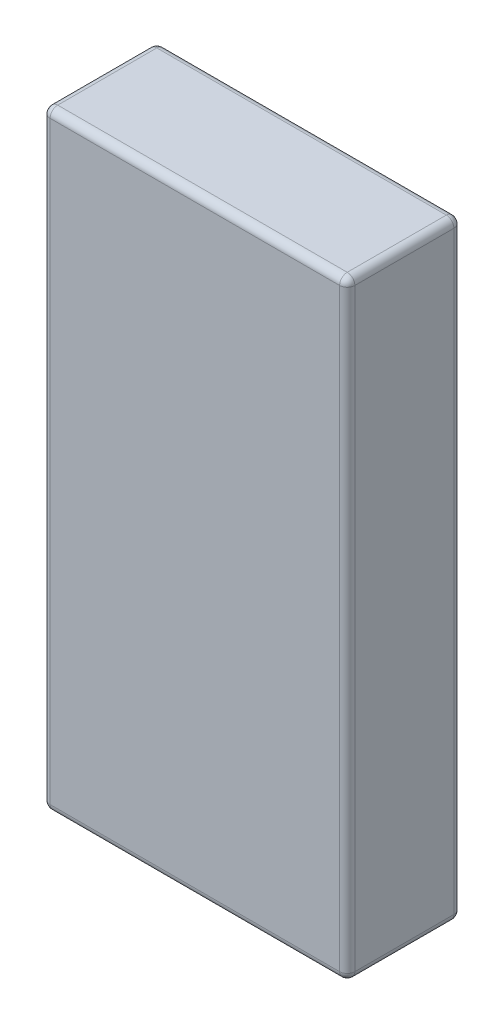
ISO-10303-21;
HEADER;
FILE_DESCRIPTION(('STEP AP214'),'2;1');
FILE_NAME('part.step','',(''),(''),'','','');
FILE_SCHEMA(('AUTOMOTIVE_DESIGN { 1 0 10303 214 1 1 1 1 }'));
ENDSEC;
DATA;
#1=APPLICATION_CONTEXT('core data for automotive mechanical design processes');
#2=APPLICATION_PROTOCOL_DEFINITION('international standard','automotive_design',2000,#1);
#3=PRODUCT_CONTEXT('',#1,'mechanical');
#4=PRODUCT('Part','Part','',(#3));
#5=PRODUCT_RELATED_PRODUCT_CATEGORY('part','',(#4));
#6=PRODUCT_DEFINITION_FORMATION('','',#4);
#7=PRODUCT_DEFINITION_CONTEXT('part definition',#1,'design');
#8=PRODUCT_DEFINITION('design','',#6,#7);
#9=PRODUCT_DEFINITION_SHAPE('','',#8);
#10=(LENGTH_UNIT() NAMED_UNIT(*) SI_UNIT(.MILLI.,.METRE.));
#11=(NAMED_UNIT(*) PLANE_ANGLE_UNIT() SI_UNIT($,.RADIAN.));
#12=(NAMED_UNIT(*) SI_UNIT($,.STERADIAN.) SOLID_ANGLE_UNIT());
#13=UNCERTAINTY_MEASURE_WITH_UNIT(LENGTH_MEASURE(1.E-05),#10,'distance_accuracy_value','');
#14=(GEOMETRIC_REPRESENTATION_CONTEXT(3) GLOBAL_UNCERTAINTY_ASSIGNED_CONTEXT((#13)) GLOBAL_UNIT_ASSIGNED_CONTEXT((#10,
#11,#12)) REPRESENTATION_CONTEXT('',''));
#15=CARTESIAN_POINT('',(0.,0.,0.));
#16=DIRECTION('',(0.,0.,1.));
#17=DIRECTION('',(1.,0.,0.));
#18=AXIS2_PLACEMENT_3D('',#15,#16,#17);
#19=CARTESIAN_POINT('',(2.,-4.,1.5));
#20=DIRECTION('',(-1.,0.,0.));
#21=DIRECTION('',(0.,0.,1.));
#22=AXIS2_PLACEMENT_3D('',#19,#20,#21);
#23=PLANE('',#22);
#24=DIRECTION('',(0.,1.,0.));
#25=VECTOR('',#24,1.);
#26=CARTESIAN_POINT('',(2.,-4.,1.4));
#27=LINE('',#26,#25);
#28=CARTESIAN_POINT('',(2.,3.9,1.4));
#29=VERTEX_POINT('',#28);
#30=CARTESIAN_POINT('',(2.,-3.9,1.4));
#31=VERTEX_POINT('',#30);
#32=EDGE_CURVE('E190',#29,#31,#27,.F.);
#33=ORIENTED_EDGE('',*,*,#32,.T.);
#34=DIRECTION('',(0.,0.,-1.));
#35=VECTOR('',#34,1.);
#36=CARTESIAN_POINT('',(2.,-3.9,1.5));
#37=LINE('',#36,#35);
#38=CARTESIAN_POINT('',(2.,-3.9,0.1));
#39=VERTEX_POINT('',#38);
#40=EDGE_CURVE('E192',#31,#39,#37,.T.);
#41=ORIENTED_EDGE('',*,*,#40,.T.);
#42=DIRECTION('',(0.,1.,0.));
#43=VECTOR('',#42,1.);
#44=CARTESIAN_POINT('',(2.,4.,0.1));
#45=LINE('',#44,#43);
#46=CARTESIAN_POINT('',(2.,3.9,0.1));
#47=VERTEX_POINT('',#46);
#48=EDGE_CURVE('E186',#39,#47,#45,.T.);
#49=ORIENTED_EDGE('',*,*,#48,.T.);
#50=DIRECTION('',(0.,0.,-1.));
#51=VECTOR('',#50,1.);
#52=CARTESIAN_POINT('',(2.,3.9,1.5));
#53=LINE('',#52,#51);
#54=EDGE_CURVE('E188',#47,#29,#53,.F.);
#55=ORIENTED_EDGE('',*,*,#54,.T.);
#56=EDGE_LOOP('',(#33,#41,#49,#55));
#57=FACE_BOUND('',#56,.T.);
#58=ADVANCED_FACE('F35',(#57),#23,.F.);
#59=CARTESIAN_POINT('',(-2.,4.,1.5));
#60=DIRECTION('',(0.,-1.,0.));
#61=DIRECTION('',(0.,0.,-1.));
#62=AXIS2_PLACEMENT_3D('',#59,#60,#61);
#63=PLANE('',#62);
#64=DIRECTION('',(0.,0.,-1.));
#65=VECTOR('',#64,1.);
#66=CARTESIAN_POINT('',(-1.9,4.,1.5));
#67=LINE('',#66,#65);
#68=CARTESIAN_POINT('',(-1.9,4.,0.1));
#69=VERTEX_POINT('',#68);
#70=CARTESIAN_POINT('',(-1.9,4.,1.4));
#71=VERTEX_POINT('',#70);
#72=EDGE_CURVE('E181',#69,#71,#67,.F.);
#73=ORIENTED_EDGE('',*,*,#72,.T.);
#74=DIRECTION('',(-1.,0.,0.));
#75=VECTOR('',#74,1.);
#76=CARTESIAN_POINT('',(-2.,4.,1.4));
#77=LINE('',#76,#75);
#78=CARTESIAN_POINT('',(1.9,4.,1.4));
#79=VERTEX_POINT('',#78);
#80=EDGE_CURVE('E183',#71,#79,#77,.F.);
#81=ORIENTED_EDGE('',*,*,#80,.T.);
#82=DIRECTION('',(0.,0.,-1.));
#83=VECTOR('',#82,1.);
#84=CARTESIAN_POINT('',(1.9,4.,1.5));
#85=LINE('',#84,#83);
#86=CARTESIAN_POINT('',(1.9,4.,0.1));
#87=VERTEX_POINT('',#86);
#88=EDGE_CURVE('E179',#79,#87,#85,.T.);
#89=ORIENTED_EDGE('',*,*,#88,.T.);
#90=DIRECTION('',(-1.,0.,0.));
#91=VECTOR('',#90,1.);
#92=CARTESIAN_POINT('',(-2.,4.,0.1));
#93=LINE('',#92,#91);
#94=EDGE_CURVE('E177',#87,#69,#93,.T.);
#95=ORIENTED_EDGE('',*,*,#94,.T.);
#96=EDGE_LOOP('',(#73,#81,#89,#95));
#97=FACE_BOUND('',#96,.T.);
#98=ADVANCED_FACE('F267',(#97),#63,.F.);
#99=CARTESIAN_POINT('',(-2.,-4.,1.5));
#100=DIRECTION('',(1.,0.,0.));
#101=DIRECTION('',(0.,0.,-1.));
#102=AXIS2_PLACEMENT_3D('',#99,#100,#101);
#103=PLANE('',#102);
#104=DIRECTION('',(0.,-1.,0.));
#105=VECTOR('',#104,1.);
#106=CARTESIAN_POINT('',(-2.,-4.,0.1));
#107=LINE('',#106,#105);
#108=CARTESIAN_POINT('',(-2.,3.9,0.1));
#109=VERTEX_POINT('',#108);
#110=CARTESIAN_POINT('',(-2.,-3.9,0.1));
#111=VERTEX_POINT('',#110);
#112=EDGE_CURVE('E157',#109,#111,#107,.T.);
#113=ORIENTED_EDGE('',*,*,#112,.T.);
#114=DIRECTION('',(0.,0.,-1.));
#115=VECTOR('',#114,1.);
#116=CARTESIAN_POINT('',(-2.,-3.9,1.5));
#117=LINE('',#116,#115);
#118=CARTESIAN_POINT('',(-2.,-3.9,1.4));
#119=VERTEX_POINT('',#118);
#120=EDGE_CURVE('E130',#111,#119,#117,.F.);
#121=ORIENTED_EDGE('',*,*,#120,.T.);
#122=DIRECTION('',(0.,-1.,0.));
#123=VECTOR('',#122,1.);
#124=CARTESIAN_POINT('',(-2.,-4.,1.4));
#125=LINE('',#124,#123);
#126=CARTESIAN_POINT('',(-2.,3.9,1.4));
#127=VERTEX_POINT('',#126);
#128=EDGE_CURVE('E165',#119,#127,#125,.F.);
#129=ORIENTED_EDGE('',*,*,#128,.T.);
#130=DIRECTION('',(0.,0.,-1.));
#131=VECTOR('',#130,1.);
#132=CARTESIAN_POINT('',(-2.,3.9,1.5));
#133=LINE('',#132,#131);
#134=EDGE_CURVE('E159',#127,#109,#133,.T.);
#135=ORIENTED_EDGE('',*,*,#134,.T.);
#136=EDGE_LOOP('',(#113,#121,#129,#135));
#137=FACE_BOUND('',#136,.T.);
#138=ADVANCED_FACE('F328',(#137),#103,.F.);
#139=CARTESIAN_POINT('',(-2.,-4.,1.5));
#140=DIRECTION('',(0.,1.,0.));
#141=DIRECTION('',(0.,0.,1.));
#142=AXIS2_PLACEMENT_3D('',#139,#140,#141);
#143=PLANE('',#142);
#144=DIRECTION('',(1.,0.,0.));
#145=VECTOR('',#144,1.);
#146=CARTESIAN_POINT('',(-2.,-4.,1.4));
#147=LINE('',#146,#145);
#148=CARTESIAN_POINT('',(1.9,-4.,1.4));
#149=VERTEX_POINT('',#148);
#150=CARTESIAN_POINT('',(-1.9,-4.,1.4));
#151=VERTEX_POINT('',#150);
#152=EDGE_CURVE('E155',#149,#151,#147,.F.);
#153=ORIENTED_EDGE('',*,*,#152,.T.);
#154=DIRECTION('',(0.,0.,-1.));
#155=VECTOR('',#154,1.);
#156=CARTESIAN_POINT('',(-1.9,-4.,1.5));
#157=LINE('',#156,#155);
#158=CARTESIAN_POINT('',(-1.9,-4.,0.1));
#159=VERTEX_POINT('',#158);
#160=EDGE_CURVE('E128',#151,#159,#157,.T.);
#161=ORIENTED_EDGE('',*,*,#160,.T.);
#162=DIRECTION('',(1.,0.,0.));
#163=VECTOR('',#162,1.);
#164=CARTESIAN_POINT('',(2.,-4.,0.1));
#165=LINE('',#164,#163);
#166=CARTESIAN_POINT('',(1.9,-4.,0.1));
#167=VERTEX_POINT('',#166);
#168=EDGE_CURVE('E145',#159,#167,#165,.T.);
#169=ORIENTED_EDGE('',*,*,#168,.T.);
#170=DIRECTION('',(0.,0.,-1.));
#171=VECTOR('',#170,1.);
#172=CARTESIAN_POINT('',(1.9,-4.,1.5));
#173=LINE('',#172,#171);
#174=EDGE_CURVE('E151',#167,#149,#173,.F.);
#175=ORIENTED_EDGE('',*,*,#174,.T.);
#176=EDGE_LOOP('',(#153,#161,#169,#175));
#177=FACE_BOUND('',#176,.T.);
#178=ADVANCED_FACE('F153',(#177),#143,.F.);
#179=CARTESIAN_POINT('',(0.,0.,1.5));
#180=DIRECTION('',(0.,0.,-1.));
#181=DIRECTION('',(-1.,0.,0.));
#182=AXIS2_PLACEMENT_3D('',#179,#180,#181);
#183=PLANE('',#182);
#184=DIRECTION('',(0.,-1.,0.));
#185=VECTOR('',#184,1.);
#186=CARTESIAN_POINT('',(-1.9,0.,1.5));
#187=LINE('',#186,#185);
#188=CARTESIAN_POINT('',(-1.9,3.9,1.5));
#189=VERTEX_POINT('',#188);
#190=CARTESIAN_POINT('',(-1.9,-3.9,1.5));
#191=VERTEX_POINT('',#190);
#192=EDGE_CURVE('E172',#189,#191,#187,.T.);
#193=ORIENTED_EDGE('',*,*,#192,.T.);
#194=DIRECTION('',(1.,0.,0.));
#195=VECTOR('',#194,1.);
#196=CARTESIAN_POINT('',(0.,-3.9,1.5));
#197=LINE('',#196,#195);
#198=CARTESIAN_POINT('',(1.9,-3.9,1.5));
#199=VERTEX_POINT('',#198);
#200=EDGE_CURVE('E174',#191,#199,#197,.T.);
#201=ORIENTED_EDGE('',*,*,#200,.T.);
#202=DIRECTION('',(0.,1.,0.));
#203=VECTOR('',#202,1.);
#204=CARTESIAN_POINT('',(1.9,0.,1.5));
#205=LINE('',#204,#203);
#206=CARTESIAN_POINT('',(1.9,3.9,1.5));
#207=VERTEX_POINT('',#206);
#208=EDGE_CURVE('E168',#199,#207,#205,.T.);
#209=ORIENTED_EDGE('',*,*,#208,.T.);
#210=DIRECTION('',(-1.,0.,0.));
#211=VECTOR('',#210,1.);
#212=CARTESIAN_POINT('',(0.,3.9,1.5));
#213=LINE('',#212,#211);
#214=EDGE_CURVE('E170',#207,#189,#213,.T.);
#215=ORIENTED_EDGE('',*,*,#214,.T.);
#216=EDGE_LOOP('',(#193,#201,#209,#215));
#217=FACE_BOUND('',#216,.T.);
#218=ADVANCED_FACE('F288',(#217),#183,.F.);
#219=CARTESIAN_POINT('',(0.,0.,0.));
#220=DIRECTION('',(0.,0.,-1.));
#221=DIRECTION('',(-1.,0.,0.));
#222=AXIS2_PLACEMENT_3D('',#219,#220,#221);
#223=PLANE('',#222);
#224=DIRECTION('',(0.,-1.,0.));
#225=VECTOR('',#224,1.);
#226=CARTESIAN_POINT('',(-1.9,4.,0.));
#227=LINE('',#226,#225);
#228=CARTESIAN_POINT('',(-1.9,-3.9,0.));
#229=VERTEX_POINT('',#228);
#230=CARTESIAN_POINT('',(-1.9,3.9,0.));
#231=VERTEX_POINT('',#230);
#232=EDGE_CURVE('E44',#229,#231,#227,.F.);
#233=ORIENTED_EDGE('',*,*,#232,.T.);
#234=DIRECTION('',(-1.,0.,0.));
#235=VECTOR('',#234,1.);
#236=CARTESIAN_POINT('',(2.,3.9,0.));
#237=LINE('',#236,#235);
#238=CARTESIAN_POINT('',(1.9,3.9,0.));
#239=VERTEX_POINT('',#238);
#240=EDGE_CURVE('E11',#231,#239,#237,.F.);
#241=ORIENTED_EDGE('',*,*,#240,.T.);
#242=DIRECTION('',(0.,1.,0.));
#243=VECTOR('',#242,1.);
#244=CARTESIAN_POINT('',(1.9,-4.,0.));
#245=LINE('',#244,#243);
#246=CARTESIAN_POINT('',(1.9,-3.9,0.));
#247=VERTEX_POINT('',#246);
#248=EDGE_CURVE('E195',#239,#247,#245,.F.);
#249=ORIENTED_EDGE('',*,*,#248,.T.);
#250=DIRECTION('',(1.,0.,0.));
#251=VECTOR('',#250,1.);
#252=CARTESIAN_POINT('',(-2.,-3.9,0.));
#253=LINE('',#252,#251);
#254=EDGE_CURVE('E55',#247,#229,#253,.F.);
#255=ORIENTED_EDGE('',*,*,#254,.T.);
#256=EDGE_LOOP('',(#233,#241,#249,#255));
#257=FACE_BOUND('',#256,.T.);
#258=ADVANCED_FACE('F314',(#257),#223,.T.);
#259=CARTESIAN_POINT('',(1.9,3.9,1.5));
#260=DIRECTION('',(0.,0.,-1.));
#261=DIRECTION('',(-1.,0.,0.));
#262=AXIS2_PLACEMENT_3D('',#259,#260,#261);
#263=CYLINDRICAL_SURFACE('',#262,0.1);
#264=CARTESIAN_POINT('',(1.9,3.9,1.4));
#265=DIRECTION('',(0.,0.,1.));
#266=DIRECTION('',(1.,0.,0.));
#267=AXIS2_PLACEMENT_3D('',#264,#265,#266);
#268=CIRCLE('',#267,0.1);
#269=EDGE_CURVE('E39',#29,#79,#268,.T.);
#270=ORIENTED_EDGE('',*,*,#269,.F.);
#271=ORIENTED_EDGE('',*,*,#54,.F.);
#272=CARTESIAN_POINT('',(1.9,3.9,0.1));
#273=DIRECTION('',(0.,0.,-1.));
#274=DIRECTION('',(-1.,0.,0.));
#275=AXIS2_PLACEMENT_3D('',#272,#273,#274);
#276=CIRCLE('',#275,0.1);
#277=EDGE_CURVE('E248',#87,#47,#276,.T.);
#278=ORIENTED_EDGE('',*,*,#277,.F.);
#279=ORIENTED_EDGE('',*,*,#88,.F.);
#280=EDGE_LOOP('',(#270,#271,#278,#279));
#281=FACE_BOUND('',#280,.T.);
#282=ADVANCED_FACE('F37',(#281),#263,.T.);
#283=CARTESIAN_POINT('',(1.9,3.9,1.4));
#284=DIRECTION('',(0.,0.,1.));
#285=DIRECTION('',(1.,0.,0.));
#286=AXIS2_PLACEMENT_3D('',#283,#284,#285);
#287=SPHERICAL_SURFACE('',#286,0.1);
#288=CARTESIAN_POINT('',(1.9,3.9,1.4));
#289=DIRECTION('',(0.,1.,0.));
#290=DIRECTION('',(0.,0.,1.));
#291=AXIS2_PLACEMENT_3D('',#288,#289,#290);
#292=CIRCLE('',#291,0.1);
#293=EDGE_CURVE('E244',#29,#207,#292,.F.);
#294=ORIENTED_EDGE('',*,*,#293,.F.);
#295=ORIENTED_EDGE('',*,*,#269,.T.);
#296=CARTESIAN_POINT('',(1.9,3.9,1.4));
#297=DIRECTION('',(1.,0.,0.));
#298=DIRECTION('',(0.,0.,-1.));
#299=AXIS2_PLACEMENT_3D('',#296,#297,#298);
#300=CIRCLE('',#299,0.1);
#301=EDGE_CURVE('E247',#207,#79,#300,.F.);
#302=ORIENTED_EDGE('',*,*,#301,.F.);
#303=EDGE_LOOP('',(#294,#295,#302));
#304=FACE_BOUND('',#303,.T.);
#305=ADVANCED_FACE('F260',(#304),#287,.T.);
#306=CARTESIAN_POINT('',(1.9,3.9,0.1));
#307=DIRECTION('',(0.,0.,1.));
#308=DIRECTION('',(1.,0.,0.));
#309=AXIS2_PLACEMENT_3D('',#306,#307,#308);
#310=SPHERICAL_SURFACE('',#309,0.1);
#311=CARTESIAN_POINT('',(1.9,3.9,0.1));
#312=DIRECTION('',(1.,0.,0.));
#313=DIRECTION('',(0.,1.,0.));
#314=AXIS2_PLACEMENT_3D('',#311,#312,#313);
#315=CIRCLE('',#314,0.1);
#316=EDGE_CURVE('E238',#87,#239,#315,.F.);
#317=ORIENTED_EDGE('',*,*,#316,.F.);
#318=ORIENTED_EDGE('',*,*,#277,.T.);
#319=CARTESIAN_POINT('',(1.9,3.9,0.1));
#320=DIRECTION('',(0.,1.,0.));
#321=DIRECTION('',(0.,0.,1.));
#322=AXIS2_PLACEMENT_3D('',#319,#320,#321);
#323=CIRCLE('',#322,0.1);
#324=EDGE_CURVE('E241',#239,#47,#323,.F.);
#325=ORIENTED_EDGE('',*,*,#324,.F.);
#326=EDGE_LOOP('',(#317,#318,#325));
#327=FACE_BOUND('',#326,.T.);
#328=ADVANCED_FACE('F310',(#327),#310,.T.);
#329=CARTESIAN_POINT('',(0.,3.9,1.4));
#330=DIRECTION('',(-1.,0.,0.));
#331=DIRECTION('',(0.,0.,1.));
#332=AXIS2_PLACEMENT_3D('',#329,#330,#331);
#333=CYLINDRICAL_SURFACE('',#332,0.1);
#334=ORIENTED_EDGE('',*,*,#301,.T.);
#335=ORIENTED_EDGE('',*,*,#80,.F.);
#336=CARTESIAN_POINT('',(-1.9,3.9,1.4));
#337=DIRECTION('',(-1.,0.,0.));
#338=DIRECTION('',(0.,0.,1.));
#339=AXIS2_PLACEMENT_3D('',#336,#337,#338);
#340=CIRCLE('',#339,0.1);
#341=EDGE_CURVE('E232',#189,#71,#340,.T.);
#342=ORIENTED_EDGE('',*,*,#341,.F.);
#343=ORIENTED_EDGE('',*,*,#214,.F.);
#344=EDGE_LOOP('',(#334,#335,#342,#343));
#345=FACE_BOUND('',#344,.T.);
#346=ADVANCED_FACE('F272',(#345),#333,.T.);
#347=CARTESIAN_POINT('',(1.9,0.,1.4));
#348=DIRECTION('',(0.,1.,0.));
#349=DIRECTION('',(0.,0.,1.));
#350=AXIS2_PLACEMENT_3D('',#347,#348,#349);
#351=CYLINDRICAL_SURFACE('',#350,0.1);
#352=ORIENTED_EDGE('',*,*,#293,.T.);
#353=ORIENTED_EDGE('',*,*,#208,.F.);
#354=CARTESIAN_POINT('',(1.9,-3.9,1.4));
#355=DIRECTION('',(0.,-1.,0.));
#356=DIRECTION('',(0.,0.,-1.));
#357=AXIS2_PLACEMENT_3D('',#354,#355,#356);
#358=CIRCLE('',#357,0.1);
#359=EDGE_CURVE('E229',#31,#199,#358,.T.);
#360=ORIENTED_EDGE('',*,*,#359,.F.);
#361=ORIENTED_EDGE('',*,*,#32,.F.);
#362=EDGE_LOOP('',(#352,#353,#360,#361));
#363=FACE_BOUND('',#362,.T.);
#364=ADVANCED_FACE('F299',(#363),#351,.T.);
#365=CARTESIAN_POINT('',(1.9,-3.9,1.5));
#366=DIRECTION('',(0.,0.,-1.));
#367=DIRECTION('',(-1.,0.,0.));
#368=AXIS2_PLACEMENT_3D('',#365,#366,#367);
#369=CYLINDRICAL_SURFACE('',#368,0.1);
#370=CARTESIAN_POINT('',(1.9,-3.9,0.1));
#371=DIRECTION('',(0.,0.,-1.));
#372=DIRECTION('',(-1.,0.,0.));
#373=AXIS2_PLACEMENT_3D('',#370,#371,#372);
#374=CIRCLE('',#373,0.1);
#375=EDGE_CURVE('E223',#39,#167,#374,.T.);
#376=ORIENTED_EDGE('',*,*,#375,.F.);
#377=ORIENTED_EDGE('',*,*,#40,.F.);
#378=CARTESIAN_POINT('',(1.9,-3.9,1.4));
#379=DIRECTION('',(0.,0.,1.));
#380=DIRECTION('',(1.,0.,0.));
#381=AXIS2_PLACEMENT_3D('',#378,#379,#380);
#382=CIRCLE('',#381,0.1);
#383=EDGE_CURVE('E226',#149,#31,#382,.T.);
#384=ORIENTED_EDGE('',*,*,#383,.F.);
#385=ORIENTED_EDGE('',*,*,#174,.F.);
#386=EDGE_LOOP('',(#376,#377,#384,#385));
#387=FACE_BOUND('',#386,.T.);
#388=ADVANCED_FACE('F304',(#387),#369,.T.);
#389=CARTESIAN_POINT('',(1.9,-4.,0.1));
#390=DIRECTION('',(0.,-1.,0.));
#391=DIRECTION('',(0.,0.,-1.));
#392=AXIS2_PLACEMENT_3D('',#389,#390,#391);
#393=CYLINDRICAL_SURFACE('',#392,0.1);
#394=ORIENTED_EDGE('',*,*,#324,.T.);
#395=ORIENTED_EDGE('',*,*,#48,.F.);
#396=CARTESIAN_POINT('',(1.9,-3.9,0.1));
#397=DIRECTION('',(0.,-1.,0.));
#398=DIRECTION('',(0.,0.,-1.));
#399=AXIS2_PLACEMENT_3D('',#396,#397,#398);
#400=CIRCLE('',#399,0.1);
#401=EDGE_CURVE('E221',#247,#39,#400,.T.);
#402=ORIENTED_EDGE('',*,*,#401,.F.);
#403=ORIENTED_EDGE('',*,*,#248,.F.);
#404=EDGE_LOOP('',(#394,#395,#402,#403));
#405=FACE_BOUND('',#404,.T.);
#406=ADVANCED_FACE('F309',(#405),#393,.T.);
#407=CARTESIAN_POINT('',(-2.,3.9,0.1));
#408=DIRECTION('',(1.,0.,0.));
#409=DIRECTION('',(0.,0.,-1.));
#410=AXIS2_PLACEMENT_3D('',#407,#408,#409);
#411=CYLINDRICAL_SURFACE('',#410,0.1);
#412=ORIENTED_EDGE('',*,*,#316,.T.);
#413=ORIENTED_EDGE('',*,*,#240,.F.);
#414=CARTESIAN_POINT('',(-1.9,3.9,0.1));
#415=DIRECTION('',(-1.,0.,0.));
#416=DIRECTION('',(0.,0.,1.));
#417=AXIS2_PLACEMENT_3D('',#414,#415,#416);
#418=CIRCLE('',#417,0.1);
#419=EDGE_CURVE('E218',#69,#231,#418,.T.);
#420=ORIENTED_EDGE('',*,*,#419,.F.);
#421=ORIENTED_EDGE('',*,*,#94,.F.);
#422=EDGE_LOOP('',(#412,#413,#420,#421));
#423=FACE_BOUND('',#422,.T.);
#424=ADVANCED_FACE('F313',(#423),#411,.T.);
#425=CARTESIAN_POINT('',(-1.9,3.9,1.5));
#426=DIRECTION('',(0.,0.,-1.));
#427=DIRECTION('',(-1.,0.,0.));
#428=AXIS2_PLACEMENT_3D('',#425,#426,#427);
#429=CYLINDRICAL_SURFACE('',#428,0.1);
#430=CARTESIAN_POINT('',(-1.9,3.9,1.4));
#431=DIRECTION('',(0.,0.,1.));
#432=DIRECTION('',(1.,0.,0.));
#433=AXIS2_PLACEMENT_3D('',#430,#431,#432);
#434=CIRCLE('',#433,0.1);
#435=EDGE_CURVE('E235',#71,#127,#434,.T.);
#436=ORIENTED_EDGE('',*,*,#435,.F.);
#437=ORIENTED_EDGE('',*,*,#72,.F.);
#438=CARTESIAN_POINT('',(-1.9,3.9,0.1));
#439=DIRECTION('',(0.,0.,-1.));
#440=DIRECTION('',(-1.,0.,0.));
#441=AXIS2_PLACEMENT_3D('',#438,#439,#440);
#442=CIRCLE('',#441,0.1);
#443=EDGE_CURVE('E215',#109,#69,#442,.T.);
#444=ORIENTED_EDGE('',*,*,#443,.F.);
#445=ORIENTED_EDGE('',*,*,#134,.F.);
#446=EDGE_LOOP('',(#436,#437,#444,#445));
#447=FACE_BOUND('',#446,.T.);
#448=ADVANCED_FACE('F276',(#447),#429,.T.);
#449=CARTESIAN_POINT('',(-1.9,3.9,1.4));
#450=DIRECTION('',(0.,0.,1.));
#451=DIRECTION('',(1.,0.,0.));
#452=AXIS2_PLACEMENT_3D('',#449,#450,#451);
#453=SPHERICAL_SURFACE('',#452,0.1);
#454=ORIENTED_EDGE('',*,*,#341,.T.);
#455=ORIENTED_EDGE('',*,*,#435,.T.);
#456=CARTESIAN_POINT('',(-1.9,3.9,1.4));
#457=DIRECTION('',(0.,1.,0.));
#458=DIRECTION('',(0.,0.,1.));
#459=AXIS2_PLACEMENT_3D('',#456,#457,#458);
#460=CIRCLE('',#459,0.1);
#461=EDGE_CURVE('E212',#189,#127,#460,.F.);
#462=ORIENTED_EDGE('',*,*,#461,.F.);
#463=EDGE_LOOP('',(#454,#455,#462));
#464=FACE_BOUND('',#463,.T.);
#465=ADVANCED_FACE('F280',(#464),#453,.T.);
#466=CARTESIAN_POINT('',(1.9,-3.9,1.4));
#467=DIRECTION('',(0.,0.,1.));
#468=DIRECTION('',(1.,0.,0.));
#469=AXIS2_PLACEMENT_3D('',#466,#467,#468);
#470=SPHERICAL_SURFACE('',#469,0.1);
#471=ORIENTED_EDGE('',*,*,#383,.T.);
#472=ORIENTED_EDGE('',*,*,#359,.T.);
#473=CARTESIAN_POINT('',(1.9,-3.9,1.4));
#474=DIRECTION('',(1.,0.,0.));
#475=DIRECTION('',(0.,0.,-1.));
#476=AXIS2_PLACEMENT_3D('',#473,#474,#475);
#477=CIRCLE('',#476,0.1);
#478=EDGE_CURVE('E210',#149,#199,#477,.F.);
#479=ORIENTED_EDGE('',*,*,#478,.F.);
#480=EDGE_LOOP('',(#471,#472,#479));
#481=FACE_BOUND('',#480,.T.);
#482=ADVANCED_FACE('F296',(#481),#470,.T.);
#483=CARTESIAN_POINT('',(1.9,-3.9,0.1));
#484=DIRECTION('',(0.,0.,1.));
#485=DIRECTION('',(1.,0.,0.));
#486=AXIS2_PLACEMENT_3D('',#483,#484,#485);
#487=SPHERICAL_SURFACE('',#486,0.1);
#488=ORIENTED_EDGE('',*,*,#401,.T.);
#489=ORIENTED_EDGE('',*,*,#375,.T.);
#490=CARTESIAN_POINT('',(1.9,-3.9,0.1));
#491=DIRECTION('',(1.,0.,0.));
#492=DIRECTION('',(0.,0.,-1.));
#493=AXIS2_PLACEMENT_3D('',#490,#491,#492);
#494=CIRCLE('',#493,0.1);
#495=EDGE_CURVE('E148',#247,#167,#494,.F.);
#496=ORIENTED_EDGE('',*,*,#495,.F.);
#497=EDGE_LOOP('',(#488,#489,#496));
#498=FACE_BOUND('',#497,.T.);
#499=ADVANCED_FACE('F353',(#498),#487,.T.);
#500=CARTESIAN_POINT('',(-1.9,3.9,0.1));
#501=DIRECTION('',(0.,0.,1.));
#502=DIRECTION('',(1.,0.,0.));
#503=AXIS2_PLACEMENT_3D('',#500,#501,#502);
#504=SPHERICAL_SURFACE('',#503,0.1);
#505=ORIENTED_EDGE('',*,*,#443,.T.);
#506=ORIENTED_EDGE('',*,*,#419,.T.);
#507=CARTESIAN_POINT('',(-1.9,3.9,0.1));
#508=DIRECTION('',(0.,1.,0.));
#509=DIRECTION('',(-1.,0.,0.));
#510=AXIS2_PLACEMENT_3D('',#507,#508,#509);
#511=CIRCLE('',#510,0.1);
#512=EDGE_CURVE('E206',#109,#231,#511,.F.);
#513=ORIENTED_EDGE('',*,*,#512,.F.);
#514=EDGE_LOOP('',(#505,#506,#513));
#515=FACE_BOUND('',#514,.T.);
#516=ADVANCED_FACE('F350',(#515),#504,.T.);
#517=CARTESIAN_POINT('',(-1.9,0.,1.4));
#518=DIRECTION('',(0.,-1.,0.));
#519=DIRECTION('',(0.,0.,-1.));
#520=AXIS2_PLACEMENT_3D('',#517,#518,#519);
#521=CYLINDRICAL_SURFACE('',#520,0.1);
#522=ORIENTED_EDGE('',*,*,#461,.T.);
#523=ORIENTED_EDGE('',*,*,#128,.F.);
#524=CARTESIAN_POINT('',(-1.9,-3.9,1.4));
#525=DIRECTION('',(0.,-1.,0.));
#526=DIRECTION('',(0.,0.,-1.));
#527=AXIS2_PLACEMENT_3D('',#524,#525,#526);
#528=CIRCLE('',#527,0.1);
#529=EDGE_CURVE('E203',#191,#119,#528,.T.);
#530=ORIENTED_EDGE('',*,*,#529,.F.);
#531=ORIENTED_EDGE('',*,*,#192,.F.);
#532=EDGE_LOOP('',(#522,#523,#530,#531));
#533=FACE_BOUND('',#532,.T.);
#534=ADVANCED_FACE('F285',(#533),#521,.T.);
#535=CARTESIAN_POINT('',(0.,-3.9,1.4));
#536=DIRECTION('',(1.,0.,0.));
#537=DIRECTION('',(0.,0.,-1.));
#538=AXIS2_PLACEMENT_3D('',#535,#536,#537);
#539=CYLINDRICAL_SURFACE('',#538,0.1);
#540=ORIENTED_EDGE('',*,*,#478,.T.);
#541=ORIENTED_EDGE('',*,*,#200,.F.);
#542=CARTESIAN_POINT('',(-1.9,-3.9,1.4));
#543=DIRECTION('',(-1.,0.,0.));
#544=DIRECTION('',(0.,0.,1.));
#545=AXIS2_PLACEMENT_3D('',#542,#543,#544);
#546=CIRCLE('',#545,0.1);
#547=EDGE_CURVE('E142',#151,#191,#546,.T.);
#548=ORIENTED_EDGE('',*,*,#547,.F.);
#549=ORIENTED_EDGE('',*,*,#152,.F.);
#550=EDGE_LOOP('',(#540,#541,#548,#549));
#551=FACE_BOUND('',#550,.T.);
#552=ADVANCED_FACE('F290',(#551),#539,.T.);
#553=CARTESIAN_POINT('',(-2.,-3.9,0.1));
#554=DIRECTION('',(-1.,0.,0.));
#555=DIRECTION('',(0.,0.,1.));
#556=AXIS2_PLACEMENT_3D('',#553,#554,#555);
#557=CYLINDRICAL_SURFACE('',#556,0.1);
#558=ORIENTED_EDGE('',*,*,#495,.T.);
#559=ORIENTED_EDGE('',*,*,#168,.F.);
#560=CARTESIAN_POINT('',(-1.9,-3.9,0.1));
#561=DIRECTION('',(-1.,0.,0.));
#562=DIRECTION('',(0.,0.,1.));
#563=AXIS2_PLACEMENT_3D('',#560,#561,#562);
#564=CIRCLE('',#563,0.1);
#565=EDGE_CURVE('E136',#229,#159,#564,.T.);
#566=ORIENTED_EDGE('',*,*,#565,.F.);
#567=ORIENTED_EDGE('',*,*,#254,.F.);
#568=EDGE_LOOP('',(#558,#559,#566,#567));
#569=FACE_BOUND('',#568,.T.);
#570=ADVANCED_FACE('F146',(#569),#557,.T.);
#571=CARTESIAN_POINT('',(-1.9,-4.,0.1));
#572=DIRECTION('',(0.,1.,0.));
#573=DIRECTION('',(0.,0.,1.));
#574=AXIS2_PLACEMENT_3D('',#571,#572,#573);
#575=CYLINDRICAL_SURFACE('',#574,0.1);
#576=ORIENTED_EDGE('',*,*,#512,.T.);
#577=ORIENTED_EDGE('',*,*,#232,.F.);
#578=CARTESIAN_POINT('',(-1.9,-3.9,0.1));
#579=DIRECTION('',(0.,-1.,0.));
#580=DIRECTION('',(0.,0.,-1.));
#581=AXIS2_PLACEMENT_3D('',#578,#579,#580);
#582=CIRCLE('',#581,0.1);
#583=EDGE_CURVE('E140',#111,#229,#582,.T.);
#584=ORIENTED_EDGE('',*,*,#583,.F.);
#585=ORIENTED_EDGE('',*,*,#112,.F.);
#586=EDGE_LOOP('',(#576,#577,#584,#585));
#587=FACE_BOUND('',#586,.T.);
#588=ADVANCED_FACE('F339',(#587),#575,.T.);
#589=CARTESIAN_POINT('',(-1.9,-3.9,1.4));
#590=DIRECTION('',(0.,0.,1.));
#591=DIRECTION('',(1.,0.,0.));
#592=AXIS2_PLACEMENT_3D('',#589,#590,#591);
#593=SPHERICAL_SURFACE('',#592,0.1);
#594=ORIENTED_EDGE('',*,*,#547,.T.);
#595=ORIENTED_EDGE('',*,*,#529,.T.);
#596=CARTESIAN_POINT('',(-1.9,-3.9,1.4));
#597=DIRECTION('',(0.,0.,1.));
#598=DIRECTION('',(1.,0.,0.));
#599=AXIS2_PLACEMENT_3D('',#596,#597,#598);
#600=CIRCLE('',#599,0.1);
#601=EDGE_CURVE('E133',#151,#119,#600,.F.);
#602=ORIENTED_EDGE('',*,*,#601,.F.);
#603=EDGE_LOOP('',(#594,#595,#602));
#604=FACE_BOUND('',#603,.T.);
#605=ADVANCED_FACE('F336',(#604),#593,.T.);
#606=CARTESIAN_POINT('',(-1.9,-3.9,0.1));
#607=DIRECTION('',(0.,0.,1.));
#608=DIRECTION('',(1.,0.,0.));
#609=AXIS2_PLACEMENT_3D('',#606,#607,#608);
#610=SPHERICAL_SURFACE('',#609,0.1);
#611=ORIENTED_EDGE('',*,*,#583,.T.);
#612=ORIENTED_EDGE('',*,*,#565,.T.);
#613=CARTESIAN_POINT('',(-1.9,-3.9,0.1));
#614=DIRECTION('',(0.,0.,-1.));
#615=DIRECTION('',(-1.,0.,0.));
#616=AXIS2_PLACEMENT_3D('',#613,#614,#615);
#617=CIRCLE('',#616,0.1);
#618=EDGE_CURVE('E124',#111,#159,#617,.F.);
#619=ORIENTED_EDGE('',*,*,#618,.F.);
#620=EDGE_LOOP('',(#611,#612,#619));
#621=FACE_BOUND('',#620,.T.);
#622=ADVANCED_FACE('F138',(#621),#610,.T.);
#623=CARTESIAN_POINT('',(-1.9,-3.9,1.5));
#624=DIRECTION('',(0.,0.,-1.));
#625=DIRECTION('',(-1.,0.,0.));
#626=AXIS2_PLACEMENT_3D('',#623,#624,#625);
#627=CYLINDRICAL_SURFACE('',#626,0.1);
#628=ORIENTED_EDGE('',*,*,#601,.T.);
#629=ORIENTED_EDGE('',*,*,#120,.F.);
#630=ORIENTED_EDGE('',*,*,#618,.T.);
#631=ORIENTED_EDGE('',*,*,#160,.F.);
#632=EDGE_LOOP('',(#628,#629,#630,#631));
#633=FACE_BOUND('',#632,.T.);
#634=ADVANCED_FACE('F126',(#633),#627,.T.);
#635=CLOSED_SHELL('',(#58,#98,#138,#178,#218,#258,#282,#305,#328,#346,#364,#388,#406,#424,#448,
#465,#482,#499,#516,#534,#552,#570,#588,#605,#622,#634));
#636=MANIFOLD_SOLID_BREP('B2',#635);
#637=ADVANCED_BREP_SHAPE_REPRESENTATION('',(#18,#636),#14);
#638=SHAPE_DEFINITION_REPRESENTATION(#9,#637);
ENDSEC;
END-ISO-10303-21;
